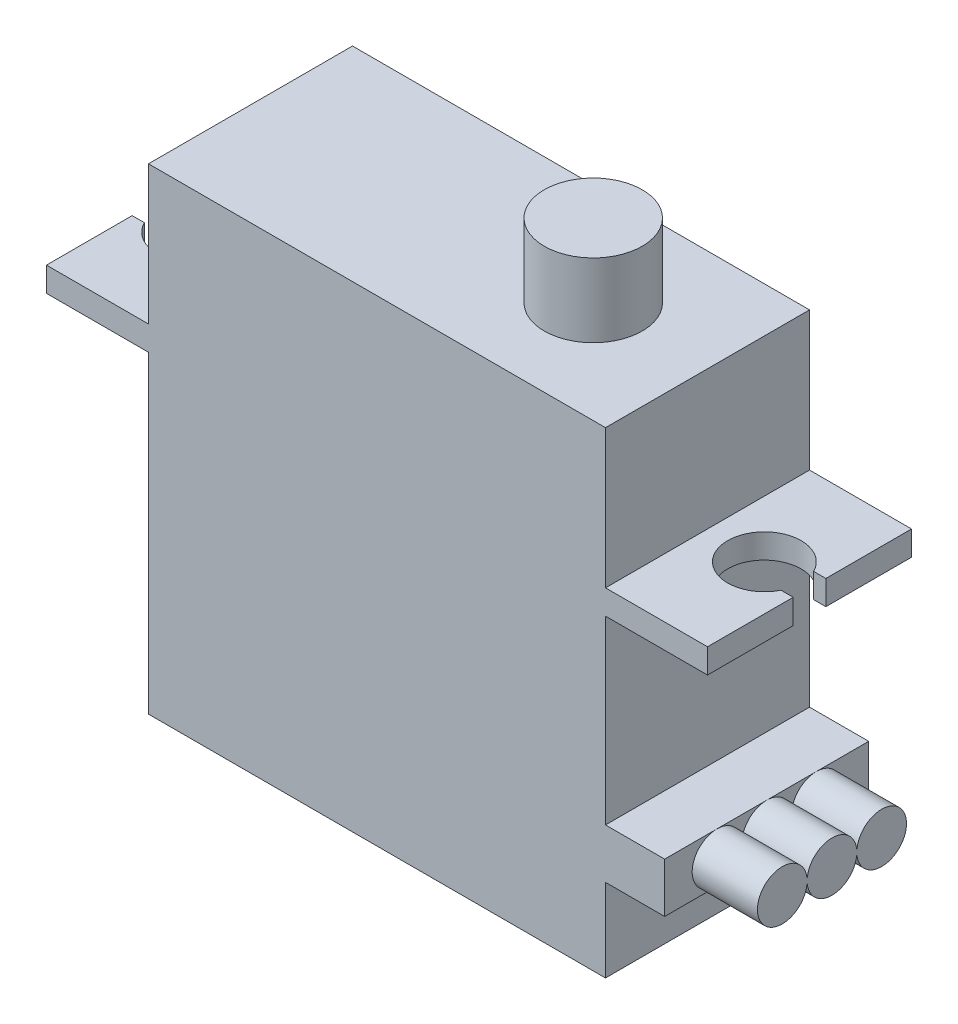
ISO-10303-21;
HEADER;
FILE_DESCRIPTION(('STEP AP214'),'2;1');
FILE_NAME('part.step','',(''),(''),'','','');
FILE_SCHEMA(('AUTOMOTIVE_DESIGN { 1 0 10303 214 1 1 1 1 }'));
ENDSEC;
DATA;
#1=APPLICATION_CONTEXT('core data for automotive mechanical design processes');
#2=APPLICATION_PROTOCOL_DEFINITION('international standard','automotive_design',2000,#1);
#3=PRODUCT_CONTEXT('',#1,'mechanical');
#4=PRODUCT('Part','Part','',(#3));
#5=PRODUCT_RELATED_PRODUCT_CATEGORY('part','',(#4));
#6=PRODUCT_DEFINITION_FORMATION('','',#4);
#7=PRODUCT_DEFINITION_CONTEXT('part definition',#1,'design');
#8=PRODUCT_DEFINITION('design','',#6,#7);
#9=PRODUCT_DEFINITION_SHAPE('','',#8);
#10=(LENGTH_UNIT() NAMED_UNIT(*) SI_UNIT(.MILLI.,.METRE.));
#11=(NAMED_UNIT(*) PLANE_ANGLE_UNIT() SI_UNIT($,.RADIAN.));
#12=(NAMED_UNIT(*) SI_UNIT($,.STERADIAN.) SOLID_ANGLE_UNIT());
#13=UNCERTAINTY_MEASURE_WITH_UNIT(LENGTH_MEASURE(1.E-05),#10,'distance_accuracy_value','');
#14=(GEOMETRIC_REPRESENTATION_CONTEXT(3) GLOBAL_UNCERTAINTY_ASSIGNED_CONTEXT((#13)) GLOBAL_UNIT_ASSIGNED_CONTEXT((#10,
#11,#12)) REPRESENTATION_CONTEXT('',''));
#15=CARTESIAN_POINT('',(0.,0.,0.));
#16=DIRECTION('',(0.,0.,1.));
#17=DIRECTION('',(1.,0.,0.));
#18=AXIS2_PLACEMENT_3D('',#15,#16,#17);
#19=CARTESIAN_POINT('',(17.6250167767219,-11.0792593212644,-10.983915300186));
#20=DIRECTION('',(1.,0.,0.));
#21=DIRECTION('',(0.,0.,-1.));
#22=AXIS2_PLACEMENT_3D('',#19,#20,#21);
#23=PLANE('',#22);
#24=CARTESIAN_POINT('',(17.6250167767219,-12.6015279767438,3.04453731095872));
#25=DIRECTION('',(-1.,0.,0.));
#26=DIRECTION('',(0.,0.,1.));
#27=AXIS2_PLACEMENT_3D('',#24,#25,#26);
#28=CIRCLE('',#27,1.52226865547936);
#29=CARTESIAN_POINT('',(17.6250167767219,-11.0792593212644,3.04453731095872));
#30=VERTEX_POINT('',#29);
#31=CARTESIAN_POINT('',(17.6250167767219,-12.4252302536132,1.53251185737868));
#32=VERTEX_POINT('',#31);
#33=EDGE_CURVE('E61',#30,#32,#28,.T.);
#34=ORIENTED_EDGE('',*,*,#33,.T.);
#35=DIRECTION('',(0.,0.,-1.));
#36=VECTOR('',#35,1.);
#37=CARTESIAN_POINT('',(17.6250167767219,-12.4252302536132,1.53251185737868));
#38=LINE('',#37,#36);
#39=CARTESIAN_POINT('',(17.6250167767219,-12.4252302536132,1.51202545358004));
#40=VERTEX_POINT('',#39);
#41=EDGE_CURVE('E326',#32,#40,#38,.T.);
#42=ORIENTED_EDGE('',*,*,#41,.T.);
#43=CARTESIAN_POINT('',(17.6250167767219,-12.6015279767438,0.));
#44=DIRECTION('',(1.,0.,0.));
#45=DIRECTION('',(0.,0.,-1.));
#46=AXIS2_PLACEMENT_3D('',#43,#44,#45);
#47=CIRCLE('',#46,1.52226865547936);
#48=CARTESIAN_POINT('',(17.6250167767219,-11.0792593212644,0.));
#49=VERTEX_POINT('',#48);
#50=EDGE_CURVE('E294',#49,#40,#47,.T.);
#51=ORIENTED_EDGE('',*,*,#50,.F.);
#52=DIRECTION('',(0.,0.,1.));
#53=VECTOR('',#52,1.);
#54=CARTESIAN_POINT('',(17.6250167767219,-11.0792593212644,-10.983915300186));
#55=LINE('',#54,#53);
#56=EDGE_CURVE('E676',#49,#30,#55,.T.);
#57=ORIENTED_EDGE('',*,*,#56,.T.);
#58=EDGE_LOOP('',(#34,#42,#51,#57));
#59=FACE_BOUND('',#58,.T.);
#60=ADVANCED_FACE('F45',(#59),#23,.T.);
#61=CARTESIAN_POINT('',(17.6250167767219,-14.1237966322231,3.04453731095872));
#62=VERTEX_POINT('',#61);
#63=EDGE_CURVE('E332',#62,#30,#28,.T.);
#64=ORIENTED_EDGE('',*,*,#63,.T.);
#65=CARTESIAN_POINT('',(17.6250167767219,-11.0792593212644,6.25));
#66=VERTEX_POINT('',#65);
#67=EDGE_CURVE('E403',#30,#66,#55,.T.);
#68=ORIENTED_EDGE('',*,*,#67,.T.);
#69=DIRECTION('',(0.,1.,0.));
#70=VECTOR('',#69,1.);
#71=CARTESIAN_POINT('',(17.6250167767219,-11.0792593212644,6.25));
#72=LINE('',#71,#70);
#73=CARTESIAN_POINT('',(17.6250167767219,-14.1237966322231,6.25));
#74=VERTEX_POINT('',#73);
#75=EDGE_CURVE('E386',#74,#66,#72,.T.);
#76=ORIENTED_EDGE('',*,*,#75,.F.);
#77=DIRECTION('',(0.,0.,1.));
#78=VECTOR('',#77,1.);
#79=CARTESIAN_POINT('',(17.6250167767219,-14.1237966322231,-10.983915300186));
#80=LINE('',#79,#78);
#81=EDGE_CURVE('E409',#62,#74,#80,.T.);
#82=ORIENTED_EDGE('',*,*,#81,.F.);
#83=EDGE_LOOP('',(#64,#68,#76,#82));
#84=FACE_BOUND('',#83,.T.);
#85=ADVANCED_FACE('F694',(#84),#23,.T.);
#86=DIRECTION('',(0.,0.,-1.));
#87=VECTOR('',#86,1.);
#88=CARTESIAN_POINT('',(17.6250167767219,-12.7778256998743,-1.51202545358004));
#89=LINE('',#88,#87);
#90=CARTESIAN_POINT('',(17.6250167767219,-12.7778256998743,-1.51202545358004));
#91=VERTEX_POINT('',#90);
#92=CARTESIAN_POINT('',(17.6250167767219,-12.7778256998743,-1.53251185737868));
#93=VERTEX_POINT('',#92);
#94=EDGE_CURVE('E340',#91,#93,#89,.T.);
#95=ORIENTED_EDGE('',*,*,#94,.F.);
#96=CARTESIAN_POINT('',(17.6250167767219,-12.6015279767438,0.));
#97=DIRECTION('',(1.,0.,0.));
#98=DIRECTION('',(0.,0.,-1.));
#99=AXIS2_PLACEMENT_3D('',#96,#97,#98);
#100=CIRCLE('',#99,1.52226865547936);
#101=CARTESIAN_POINT('',(17.6250167767219,-14.1237966322231,0.));
#102=VERTEX_POINT('',#101);
#103=EDGE_CURVE('E335',#102,#91,#100,.T.);
#104=ORIENTED_EDGE('',*,*,#103,.F.);
#105=CARTESIAN_POINT('',(17.6250167767219,-14.1237966322231,-3.04453731095872));
#106=VERTEX_POINT('',#105);
#107=EDGE_CURVE('E408',#106,#102,#80,.T.);
#108=ORIENTED_EDGE('',*,*,#107,.F.);
#109=CARTESIAN_POINT('',(17.6250167767219,-12.6015279767438,-3.04453731095872));
#110=DIRECTION('',(1.,0.,0.));
#111=DIRECTION('',(0.,0.,-1.));
#112=AXIS2_PLACEMENT_3D('',#109,#110,#111);
#113=CIRCLE('',#112,1.52226865547936);
#114=EDGE_CURVE('E345',#93,#106,#113,.T.);
#115=ORIENTED_EDGE('',*,*,#114,.F.);
#116=EDGE_LOOP('',(#95,#104,#108,#115));
#117=FACE_BOUND('',#116,.T.);
#118=ADVANCED_FACE('F713',(#117),#23,.T.);
#119=CARTESIAN_POINT('',(17.6250167767219,-11.0792593212644,-6.25));
#120=VERTEX_POINT('',#119);
#121=CARTESIAN_POINT('',(17.6250167767219,-11.0792593212644,-3.04453731095872));
#122=VERTEX_POINT('',#121);
#123=EDGE_CURVE('E398',#120,#122,#55,.T.);
#124=ORIENTED_EDGE('',*,*,#123,.T.);
#125=EDGE_CURVE('E349',#106,#122,#113,.T.);
#126=ORIENTED_EDGE('',*,*,#125,.F.);
#127=CARTESIAN_POINT('',(17.6250167767219,-14.1237966322231,-6.25));
#128=VERTEX_POINT('',#127);
#129=EDGE_CURVE('E404',#128,#106,#80,.T.);
#130=ORIENTED_EDGE('',*,*,#129,.F.);
#131=DIRECTION('',(0.,-1.,0.));
#132=VECTOR('',#131,1.);
#133=CARTESIAN_POINT('',(17.6250167767219,-11.0792593212644,-6.25));
#134=LINE('',#133,#132);
#135=EDGE_CURVE('E375',#120,#128,#134,.T.);
#136=ORIENTED_EDGE('',*,*,#135,.F.);
#137=EDGE_LOOP('',(#124,#126,#130,#136));
#138=FACE_BOUND('',#137,.T.);
#139=ADVANCED_FACE('F706',(#138),#23,.T.);
#140=EDGE_CURVE('E402',#122,#49,#55,.T.);
#141=ORIENTED_EDGE('',*,*,#140,.T.);
#142=CARTESIAN_POINT('',(17.6250167767219,-12.4252302536132,-1.51202545358004));
#143=VERTEX_POINT('',#142);
#144=EDGE_CURVE('E323',#143,#49,#47,.T.);
#145=ORIENTED_EDGE('',*,*,#144,.F.);
#146=DIRECTION('',(0.,0.,-1.));
#147=VECTOR('',#146,1.);
#148=CARTESIAN_POINT('',(17.6250167767219,-12.4252302536132,-1.51202545358004));
#149=LINE('',#148,#147);
#150=CARTESIAN_POINT('',(17.6250167767219,-12.4252302536132,-1.53251185737868));
#151=VERTEX_POINT('',#150);
#152=EDGE_CURVE('E287',#143,#151,#149,.T.);
#153=ORIENTED_EDGE('',*,*,#152,.T.);
#154=EDGE_CURVE('E344',#122,#151,#113,.T.);
#155=ORIENTED_EDGE('',*,*,#154,.F.);
#156=EDGE_LOOP('',(#141,#145,#153,#155));
#157=FACE_BOUND('',#156,.T.);
#158=ADVANCED_FACE('F740',(#157),#23,.T.);
#159=CARTESIAN_POINT('',(14.,-19.2,-6.25));
#160=DIRECTION('',(-1.,0.,0.));
#161=DIRECTION('',(0.,0.,1.));
#162=AXIS2_PLACEMENT_3D('',#159,#160,#161);
#163=PLANE('',#162);
#164=DIRECTION('',(0.,1.,0.));
#165=VECTOR('',#164,1.);
#166=CARTESIAN_POINT('',(14.,-19.2,6.25));
#167=LINE('',#166,#165);
#168=CARTESIAN_POINT('',(14.,-11.0792593212644,6.25));
#169=VERTEX_POINT('',#168);
#170=CARTESIAN_POINT('',(14.,0.,6.25));
#171=VERTEX_POINT('',#170);
#172=EDGE_CURVE('E440',#169,#171,#167,.T.);
#173=ORIENTED_EDGE('',*,*,#172,.F.);
#174=DIRECTION('',(0.,0.,1.));
#175=VECTOR('',#174,1.);
#176=CARTESIAN_POINT('',(14.,-11.0792593212644,-10.983915300186));
#177=LINE('',#176,#175);
#178=CARTESIAN_POINT('',(14.,-11.0792593212644,-6.25));
#179=VERTEX_POINT('',#178);
#180=EDGE_CURVE('E379',#179,#169,#177,.T.);
#181=ORIENTED_EDGE('',*,*,#180,.F.);
#182=DIRECTION('',(0.,1.,0.));
#183=VECTOR('',#182,1.);
#184=CARTESIAN_POINT('',(14.,-19.2,-6.25));
#185=LINE('',#184,#183);
#186=CARTESIAN_POINT('',(14.,0.,-6.25));
#187=VERTEX_POINT('',#186);
#188=EDGE_CURVE('E445',#179,#187,#185,.T.);
#189=ORIENTED_EDGE('',*,*,#188,.T.);
#190=DIRECTION('',(0.,0.,1.));
#191=VECTOR('',#190,1.);
#192=CARTESIAN_POINT('',(14.,0.,-6.25));
#193=LINE('',#192,#191);
#194=EDGE_CURVE('E421',#187,#171,#193,.T.);
#195=ORIENTED_EDGE('',*,*,#194,.T.);
#196=EDGE_LOOP('',(#173,#181,#189,#195));
#197=FACE_BOUND('',#196,.T.);
#198=ADVANCED_FACE('F759',(#197),#163,.F.);
#199=CARTESIAN_POINT('',(17.4844355629254,0.,0.));
#200=DIRECTION('',(0.,1.,0.));
#201=DIRECTION('',(0.,0.,1.));
#202=AXIS2_PLACEMENT_3D('',#199,#200,#201);
#203=PLANE('',#202);
#204=DIRECTION('',(0.,0.,-1.));
#205=VECTOR('',#204,1.);
#206=CARTESIAN_POINT('',(-14.,0.,-6.25));
#207=LINE('',#206,#205);
#208=CARTESIAN_POINT('',(-14.,0.,6.25));
#209=VERTEX_POINT('',#208);
#210=CARTESIAN_POINT('',(-14.,0.,-6.25));
#211=VERTEX_POINT('',#210);
#212=EDGE_CURVE('E415',#209,#211,#207,.T.);
#213=ORIENTED_EDGE('',*,*,#212,.F.);
#214=DIRECTION('',(1.,0.,0.));
#215=VECTOR('',#214,1.);
#216=CARTESIAN_POINT('',(20.25,0.,6.25));
#217=LINE('',#216,#215);
#218=CARTESIAN_POINT('',(-20.25,0.,6.25));
#219=VERTEX_POINT('',#218);
#220=EDGE_CURVE('E556',#219,#209,#217,.T.);
#221=ORIENTED_EDGE('',*,*,#220,.F.);
#222=DIRECTION('',(0.,0.,1.));
#223=VECTOR('',#222,1.);
#224=CARTESIAN_POINT('',(-20.25,0.,6.25));
#225=LINE('',#224,#223);
#226=CARTESIAN_POINT('',(-20.25,0.,1.));
#227=VERTEX_POINT('',#226);
#228=EDGE_CURVE('E552',#227,#219,#225,.T.);
#229=ORIENTED_EDGE('',*,*,#228,.F.);
#230=DIRECTION('',(-1.,0.,0.));
#231=VECTOR('',#230,1.);
#232=CARTESIAN_POINT('',(-19.5,0.,1.));
#233=LINE('',#232,#231);
#234=CARTESIAN_POINT('',(-19.5,0.,1.));
#235=VERTEX_POINT('',#234);
#236=EDGE_CURVE('E549',#235,#227,#233,.T.);
#237=ORIENTED_EDGE('',*,*,#236,.F.);
#238=CARTESIAN_POINT('',(-17.4844355629254,0.,0.));
#239=DIRECTION('',(0.,-1.,0.));
#240=DIRECTION('',(0.,0.,-1.));
#241=AXIS2_PLACEMENT_3D('',#238,#239,#240);
#242=CIRCLE('',#241,2.25);
#243=CARTESIAN_POINT('',(-19.5,0.,-0.999999999999998));
#244=VERTEX_POINT('',#243);
#245=EDGE_CURVE('E546',#244,#235,#242,.T.);
#246=ORIENTED_EDGE('',*,*,#245,.F.);
#247=DIRECTION('',(1.,0.,0.));
#248=VECTOR('',#247,1.);
#249=CARTESIAN_POINT('',(-19.5,0.,-0.999999999999999));
#250=LINE('',#249,#248);
#251=CARTESIAN_POINT('',(-20.25,0.,-0.999999999999999));
#252=VERTEX_POINT('',#251);
#253=EDGE_CURVE('E543',#252,#244,#250,.T.);
#254=ORIENTED_EDGE('',*,*,#253,.F.);
#255=DIRECTION('',(0.,0.,1.));
#256=VECTOR('',#255,1.);
#257=CARTESIAN_POINT('',(-20.25,0.,-0.999999999999999));
#258=LINE('',#257,#256);
#259=CARTESIAN_POINT('',(-20.25,0.,-6.25));
#260=VERTEX_POINT('',#259);
#261=EDGE_CURVE('E498',#260,#252,#258,.T.);
#262=ORIENTED_EDGE('',*,*,#261,.F.);
#263=DIRECTION('',(-1.,0.,0.));
#264=VECTOR('',#263,1.);
#265=CARTESIAN_POINT('',(20.25,0.,-6.25));
#266=LINE('',#265,#264);
#267=EDGE_CURVE('E575',#211,#260,#266,.T.);
#268=ORIENTED_EDGE('',*,*,#267,.F.);
#269=EDGE_LOOP('',(#213,#221,#229,#237,#246,#254,#262,#268));
#270=FACE_BOUND('',#269,.T.);
#271=ADVANCED_FACE('F628',(#270),#203,.F.);
#272=ORIENTED_EDGE('',*,*,#194,.F.);
#273=CARTESIAN_POINT('',(20.25,0.,-6.25));
#274=VERTEX_POINT('',#273);
#275=EDGE_CURVE('E504',#274,#187,#266,.T.);
#276=ORIENTED_EDGE('',*,*,#275,.F.);
#277=DIRECTION('',(0.,0.,-1.));
#278=VECTOR('',#277,1.);
#279=CARTESIAN_POINT('',(20.25,0.,-0.999999999999999));
#280=LINE('',#279,#278);
#281=CARTESIAN_POINT('',(20.25,0.,-0.999999999999999));
#282=VERTEX_POINT('',#281);
#283=EDGE_CURVE('E572',#282,#274,#280,.T.);
#284=ORIENTED_EDGE('',*,*,#283,.F.);
#285=DIRECTION('',(1.,0.,0.));
#286=VECTOR('',#285,1.);
#287=CARTESIAN_POINT('',(19.5,0.,-0.999999999999999));
#288=LINE('',#287,#286);
#289=CARTESIAN_POINT('',(19.5,0.,-0.999999999999999));
#290=VERTEX_POINT('',#289);
#291=EDGE_CURVE('E569',#290,#282,#288,.T.);
#292=ORIENTED_EDGE('',*,*,#291,.F.);
#293=CARTESIAN_POINT('',(17.4844355629254,0.,0.));
#294=DIRECTION('',(0.,-1.,0.));
#295=DIRECTION('',(0.,0.,1.));
#296=AXIS2_PLACEMENT_3D('',#293,#294,#295);
#297=CIRCLE('',#296,2.25);
#298=CARTESIAN_POINT('',(19.5,0.,1.));
#299=VERTEX_POINT('',#298);
#300=EDGE_CURVE('E566',#299,#290,#297,.T.);
#301=ORIENTED_EDGE('',*,*,#300,.F.);
#302=DIRECTION('',(-1.,0.,0.));
#303=VECTOR('',#302,1.);
#304=CARTESIAN_POINT('',(19.5,0.,1.));
#305=LINE('',#304,#303);
#306=CARTESIAN_POINT('',(20.25,0.,1.));
#307=VERTEX_POINT('',#306);
#308=EDGE_CURVE('E563',#307,#299,#305,.T.);
#309=ORIENTED_EDGE('',*,*,#308,.F.);
#310=DIRECTION('',(0.,0.,-1.));
#311=VECTOR('',#310,1.);
#312=CARTESIAN_POINT('',(20.25,0.,6.25));
#313=LINE('',#312,#311);
#314=CARTESIAN_POINT('',(20.25,0.,6.25));
#315=VERTEX_POINT('',#314);
#316=EDGE_CURVE('E560',#315,#307,#313,.T.);
#317=ORIENTED_EDGE('',*,*,#316,.F.);
#318=EDGE_CURVE('E555',#171,#315,#217,.T.);
#319=ORIENTED_EDGE('',*,*,#318,.F.);
#320=EDGE_LOOP('',(#272,#276,#284,#292,#301,#309,#317,#319));
#321=FACE_BOUND('',#320,.T.);
#322=ADVANCED_FACE('F938',(#321),#203,.F.);
#323=CARTESIAN_POINT('',(17.4844355629254,1.5,0.));
#324=DIRECTION('',(0.,1.,0.));
#325=DIRECTION('',(0.,0.,1.));
#326=AXIS2_PLACEMENT_3D('',#323,#324,#325);
#327=PLANE('',#326);
#328=DIRECTION('',(0.,0.,1.));
#329=VECTOR('',#328,1.);
#330=CARTESIAN_POINT('',(-14.,1.5,6.25));
#331=LINE('',#330,#329);
#332=CARTESIAN_POINT('',(-14.,1.5,-6.25));
#333=VERTEX_POINT('',#332);
#334=CARTESIAN_POINT('',(-14.,1.5,6.25));
#335=VERTEX_POINT('',#334);
#336=EDGE_CURVE('E458',#333,#335,#331,.T.);
#337=ORIENTED_EDGE('',*,*,#336,.F.);
#338=DIRECTION('',(-1.,0.,0.));
#339=VECTOR('',#338,1.);
#340=CARTESIAN_POINT('',(20.25,1.5,-6.25));
#341=LINE('',#340,#339);
#342=CARTESIAN_POINT('',(-20.25,1.5,-6.25));
#343=VERTEX_POINT('',#342);
#344=EDGE_CURVE('E535',#333,#343,#341,.T.);
#345=ORIENTED_EDGE('',*,*,#344,.T.);
#346=DIRECTION('',(0.,0.,1.));
#347=VECTOR('',#346,1.);
#348=CARTESIAN_POINT('',(-20.25,1.5,-0.999999999999999));
#349=LINE('',#348,#347);
#350=CARTESIAN_POINT('',(-20.25,1.5,-0.999999999999999));
#351=VERTEX_POINT('',#350);
#352=EDGE_CURVE('E499',#343,#351,#349,.T.);
#353=ORIENTED_EDGE('',*,*,#352,.T.);
#354=DIRECTION('',(1.,0.,0.));
#355=VECTOR('',#354,1.);
#356=CARTESIAN_POINT('',(-19.5,1.5,-0.999999999999999));
#357=LINE('',#356,#355);
#358=CARTESIAN_POINT('',(-19.5,1.5,-0.999999999999998));
#359=VERTEX_POINT('',#358);
#360=EDGE_CURVE('E503',#351,#359,#357,.T.);
#361=ORIENTED_EDGE('',*,*,#360,.T.);
#362=CARTESIAN_POINT('',(-17.4844355629254,1.5,0.));
#363=DIRECTION('',(0.,-1.,0.));
#364=DIRECTION('',(0.,0.,-1.));
#365=AXIS2_PLACEMENT_3D('',#362,#363,#364);
#366=CIRCLE('',#365,2.25);
#367=CARTESIAN_POINT('',(-19.5,1.5,1.));
#368=VERTEX_POINT('',#367);
#369=EDGE_CURVE('E507',#359,#368,#366,.T.);
#370=ORIENTED_EDGE('',*,*,#369,.T.);
#371=DIRECTION('',(-1.,0.,0.));
#372=VECTOR('',#371,1.);
#373=CARTESIAN_POINT('',(-19.5,1.5,1.));
#374=LINE('',#373,#372);
#375=CARTESIAN_POINT('',(-20.25,1.5,1.));
#376=VERTEX_POINT('',#375);
#377=EDGE_CURVE('E510',#368,#376,#374,.T.);
#378=ORIENTED_EDGE('',*,*,#377,.T.);
#379=DIRECTION('',(0.,0.,1.));
#380=VECTOR('',#379,1.);
#381=CARTESIAN_POINT('',(-20.25,1.5,6.25));
#382=LINE('',#381,#380);
#383=CARTESIAN_POINT('',(-20.25,1.5,6.25));
#384=VERTEX_POINT('',#383);
#385=EDGE_CURVE('E513',#376,#384,#382,.T.);
#386=ORIENTED_EDGE('',*,*,#385,.T.);
#387=DIRECTION('',(1.,0.,0.));
#388=VECTOR('',#387,1.);
#389=CARTESIAN_POINT('',(20.25,1.5,6.25));
#390=LINE('',#389,#388);
#391=EDGE_CURVE('E517',#384,#335,#390,.T.);
#392=ORIENTED_EDGE('',*,*,#391,.T.);
#393=EDGE_LOOP('',(#337,#345,#353,#361,#370,#378,#386,#392));
#394=FACE_BOUND('',#393,.T.);
#395=ADVANCED_FACE('F642',(#394),#327,.T.);
#396=CARTESIAN_POINT('',(-20.25,1.5,-0.999999999999999));
#397=DIRECTION('',(1.,0.,0.));
#398=DIRECTION('',(0.,0.,-1.));
#399=AXIS2_PLACEMENT_3D('',#396,#397,#398);
#400=PLANE('',#399);
#401=ORIENTED_EDGE('',*,*,#261,.T.);
#402=DIRECTION('',(0.,-1.,0.));
#403=VECTOR('',#402,1.);
#404=CARTESIAN_POINT('',(-20.25,1.5,-0.999999999999999));
#405=LINE('',#404,#403);
#406=EDGE_CURVE('E11',#351,#252,#405,.T.);
#407=ORIENTED_EDGE('',*,*,#406,.F.);
#408=ORIENTED_EDGE('',*,*,#352,.F.);
#409=DIRECTION('',(0.,-1.,0.));
#410=VECTOR('',#409,1.);
#411=CARTESIAN_POINT('',(-20.25,1.5,-6.25));
#412=LINE('',#411,#410);
#413=EDGE_CURVE('E539',#343,#260,#412,.T.);
#414=ORIENTED_EDGE('',*,*,#413,.T.);
#415=EDGE_LOOP('',(#401,#407,#408,#414));
#416=FACE_BOUND('',#415,.T.);
#417=ADVANCED_FACE('F47',(#416),#400,.F.);
#418=CARTESIAN_POINT('',(-19.5,1.5,-0.999999999999999));
#419=DIRECTION('',(0.,0.,-1.));
#420=DIRECTION('',(-1.,0.,0.));
#421=AXIS2_PLACEMENT_3D('',#418,#419,#420);
#422=PLANE('',#421);
#423=ORIENTED_EDGE('',*,*,#253,.T.);
#424=DIRECTION('',(0.,-1.,0.));
#425=VECTOR('',#424,1.);
#426=CARTESIAN_POINT('',(-19.5,1.5,-0.999999999999998));
#427=LINE('',#426,#425);
#428=EDGE_CURVE('E54',#359,#244,#427,.T.);
#429=ORIENTED_EDGE('',*,*,#428,.F.);
#430=ORIENTED_EDGE('',*,*,#360,.F.);
#431=ORIENTED_EDGE('',*,*,#406,.T.);
#432=EDGE_LOOP('',(#423,#429,#430,#431));
#433=FACE_BOUND('',#432,.T.);
#434=ADVANCED_FACE('F645',(#433),#422,.F.);
#435=CARTESIAN_POINT('',(-17.4844355629254,1.5,0.));
#436=DIRECTION('',(0.,-1.,0.));
#437=DIRECTION('',(0.,0.,-1.));
#438=AXIS2_PLACEMENT_3D('',#435,#436,#437);
#439=CYLINDRICAL_SURFACE('',#438,2.25);
#440=ORIENTED_EDGE('',*,*,#245,.T.);
#441=DIRECTION('',(0.,-1.,0.));
#442=VECTOR('',#441,1.);
#443=CARTESIAN_POINT('',(-19.5,1.5,1.));
#444=LINE('',#443,#442);
#445=EDGE_CURVE('E614',#368,#235,#444,.T.);
#446=ORIENTED_EDGE('',*,*,#445,.F.);
#447=ORIENTED_EDGE('',*,*,#369,.F.);
#448=ORIENTED_EDGE('',*,*,#428,.T.);
#449=EDGE_LOOP('',(#440,#446,#447,#448));
#450=FACE_BOUND('',#449,.T.);
#451=ADVANCED_FACE('F623',(#450),#439,.F.);
#452=CARTESIAN_POINT('',(-19.5,1.5,1.));
#453=DIRECTION('',(0.,0.,1.));
#454=DIRECTION('',(1.,0.,0.));
#455=AXIS2_PLACEMENT_3D('',#452,#453,#454);
#456=PLANE('',#455);
#457=ORIENTED_EDGE('',*,*,#236,.T.);
#458=DIRECTION('',(0.,-1.,0.));
#459=VECTOR('',#458,1.);
#460=CARTESIAN_POINT('',(-20.25,1.5,1.));
#461=LINE('',#460,#459);
#462=EDGE_CURVE('E610',#376,#227,#461,.T.);
#463=ORIENTED_EDGE('',*,*,#462,.F.);
#464=ORIENTED_EDGE('',*,*,#377,.F.);
#465=ORIENTED_EDGE('',*,*,#445,.T.);
#466=EDGE_LOOP('',(#457,#463,#464,#465));
#467=FACE_BOUND('',#466,.T.);
#468=ADVANCED_FACE('F634',(#467),#456,.F.);
#469=CARTESIAN_POINT('',(-20.25,1.5,6.25));
#470=DIRECTION('',(1.,0.,0.));
#471=DIRECTION('',(0.,0.,-1.));
#472=AXIS2_PLACEMENT_3D('',#469,#470,#471);
#473=PLANE('',#472);
#474=ORIENTED_EDGE('',*,*,#228,.T.);
#475=DIRECTION('',(0.,-1.,0.));
#476=VECTOR('',#475,1.);
#477=CARTESIAN_POINT('',(-20.25,1.5,6.25));
#478=LINE('',#477,#476);
#479=EDGE_CURVE('E606',#384,#219,#478,.T.);
#480=ORIENTED_EDGE('',*,*,#479,.F.);
#481=ORIENTED_EDGE('',*,*,#385,.F.);
#482=ORIENTED_EDGE('',*,*,#462,.T.);
#483=EDGE_LOOP('',(#474,#480,#481,#482));
#484=FACE_BOUND('',#483,.T.);
#485=ADVANCED_FACE('F638',(#484),#473,.F.);
#486=CARTESIAN_POINT('',(20.25,1.5,6.25));
#487=DIRECTION('',(0.,0.,-1.));
#488=DIRECTION('',(-1.,0.,0.));
#489=AXIS2_PLACEMENT_3D('',#486,#487,#488);
#490=PLANE('',#489);
#491=ORIENTED_EDGE('',*,*,#220,.T.);
#492=DIRECTION('',(0.,1.,0.));
#493=VECTOR('',#492,1.);
#494=CARTESIAN_POINT('',(-14.,-19.2,6.25));
#495=LINE('',#494,#493);
#496=CARTESIAN_POINT('',(-14.,-19.2,6.25));
#497=VERTEX_POINT('',#496);
#498=EDGE_CURVE('E430',#497,#209,#495,.T.);
#499=ORIENTED_EDGE('',*,*,#498,.F.);
#500=DIRECTION('',(-1.,0.,0.));
#501=VECTOR('',#500,1.);
#502=CARTESIAN_POINT('',(14.,-19.2,6.25));
#503=LINE('',#502,#501);
#504=CARTESIAN_POINT('',(14.,-19.2,6.25));
#505=VERTEX_POINT('',#504);
#506=EDGE_CURVE('E427',#505,#497,#503,.T.);
#507=ORIENTED_EDGE('',*,*,#506,.F.);
#508=CARTESIAN_POINT('',(14.,-14.1237966322231,6.25));
#509=VERTEX_POINT('',#508);
#510=EDGE_CURVE('E441',#505,#509,#167,.T.);
#511=ORIENTED_EDGE('',*,*,#510,.T.);
#512=DIRECTION('',(1.,0.,0.));
#513=VECTOR('',#512,1.);
#514=CARTESIAN_POINT('',(14.,-14.1237966322231,6.25));
#515=LINE('',#514,#513);
#516=EDGE_CURVE('E298',#509,#74,#515,.T.);
#517=ORIENTED_EDGE('',*,*,#516,.T.);
#518=ORIENTED_EDGE('',*,*,#75,.T.);
#519=DIRECTION('',(-1.,0.,0.));
#520=VECTOR('',#519,1.);
#521=CARTESIAN_POINT('',(14.,-11.0792593212644,6.25));
#522=LINE('',#521,#520);
#523=EDGE_CURVE('E390',#66,#169,#522,.T.);
#524=ORIENTED_EDGE('',*,*,#523,.T.);
#525=ORIENTED_EDGE('',*,*,#172,.T.);
#526=ORIENTED_EDGE('',*,*,#318,.T.);
#527=DIRECTION('',(0.,-1.,0.));
#528=VECTOR('',#527,1.);
#529=CARTESIAN_POINT('',(20.25,1.5,6.25));
#530=LINE('',#529,#528);
#531=CARTESIAN_POINT('',(20.25,1.5,6.25));
#532=VERTEX_POINT('',#531);
#533=EDGE_CURVE('E602',#532,#315,#530,.T.);
#534=ORIENTED_EDGE('',*,*,#533,.F.);
#535=CARTESIAN_POINT('',(14.,1.5,6.25));
#536=VERTEX_POINT('',#535);
#537=EDGE_CURVE('E516',#536,#532,#390,.T.);
#538=ORIENTED_EDGE('',*,*,#537,.F.);
#539=DIRECTION('',(0.,-1.,0.));
#540=VECTOR('',#539,1.);
#541=CARTESIAN_POINT('',(14.,10.,6.25));
#542=LINE('',#541,#540);
#543=CARTESIAN_POINT('',(14.,10.,6.25));
#544=VERTEX_POINT('',#543);
#545=EDGE_CURVE('E490',#544,#536,#542,.T.);
#546=ORIENTED_EDGE('',*,*,#545,.F.);
#547=DIRECTION('',(1.,0.,0.));
#548=VECTOR('',#547,1.);
#549=CARTESIAN_POINT('',(14.,10.,6.25));
#550=LINE('',#549,#548);
#551=CARTESIAN_POINT('',(-14.,10.,6.25));
#552=VERTEX_POINT('',#551);
#553=EDGE_CURVE('E466',#552,#544,#550,.T.);
#554=ORIENTED_EDGE('',*,*,#553,.F.);
#555=DIRECTION('',(0.,-1.,0.));
#556=VECTOR('',#555,1.);
#557=CARTESIAN_POINT('',(-14.,10.,6.25));
#558=LINE('',#557,#556);
#559=EDGE_CURVE('E494',#552,#335,#558,.T.);
#560=ORIENTED_EDGE('',*,*,#559,.T.);
#561=ORIENTED_EDGE('',*,*,#391,.F.);
#562=ORIENTED_EDGE('',*,*,#479,.T.);
#563=EDGE_LOOP('',(#491,#499,#507,#511,#517,#518,#524,#525,#526,#534,#538,#546,#554,#560,#561,#562));
#564=FACE_BOUND('',#563,.T.);
#565=ADVANCED_FACE('F659',(#564),#490,.F.);
#566=CARTESIAN_POINT('',(20.25,1.5,6.25));
#567=DIRECTION('',(-1.,0.,0.));
#568=DIRECTION('',(0.,0.,1.));
#569=AXIS2_PLACEMENT_3D('',#566,#567,#568);
#570=PLANE('',#569);
#571=ORIENTED_EDGE('',*,*,#316,.T.);
#572=DIRECTION('',(0.,-1.,0.));
#573=VECTOR('',#572,1.);
#574=CARTESIAN_POINT('',(20.25,1.5,1.));
#575=LINE('',#574,#573);
#576=CARTESIAN_POINT('',(20.25,1.5,1.));
#577=VERTEX_POINT('',#576);
#578=EDGE_CURVE('E598',#577,#307,#575,.T.);
#579=ORIENTED_EDGE('',*,*,#578,.F.);
#580=DIRECTION('',(0.,0.,-1.));
#581=VECTOR('',#580,1.);
#582=CARTESIAN_POINT('',(20.25,1.5,6.25));
#583=LINE('',#582,#581);
#584=EDGE_CURVE('E520',#532,#577,#583,.T.);
#585=ORIENTED_EDGE('',*,*,#584,.F.);
#586=ORIENTED_EDGE('',*,*,#533,.T.);
#587=EDGE_LOOP('',(#571,#579,#585,#586));
#588=FACE_BOUND('',#587,.T.);
#589=ADVANCED_FACE('F903',(#588),#570,.F.);
#590=CARTESIAN_POINT('',(19.5,1.5,1.));
#591=DIRECTION('',(0.,0.,1.));
#592=DIRECTION('',(1.,0.,0.));
#593=AXIS2_PLACEMENT_3D('',#590,#591,#592);
#594=PLANE('',#593);
#595=ORIENTED_EDGE('',*,*,#308,.T.);
#596=DIRECTION('',(0.,-1.,0.));
#597=VECTOR('',#596,1.);
#598=CARTESIAN_POINT('',(19.5,1.5,1.));
#599=LINE('',#598,#597);
#600=CARTESIAN_POINT('',(19.5,1.5,1.));
#601=VERTEX_POINT('',#600);
#602=EDGE_CURVE('E594',#601,#299,#599,.T.);
#603=ORIENTED_EDGE('',*,*,#602,.F.);
#604=DIRECTION('',(-1.,0.,0.));
#605=VECTOR('',#604,1.);
#606=CARTESIAN_POINT('',(19.5,1.5,1.));
#607=LINE('',#606,#605);
#608=EDGE_CURVE('E523',#577,#601,#607,.T.);
#609=ORIENTED_EDGE('',*,*,#608,.F.);
#610=ORIENTED_EDGE('',*,*,#578,.T.);
#611=EDGE_LOOP('',(#595,#603,#609,#610));
#612=FACE_BOUND('',#611,.T.);
#613=ADVANCED_FACE('F1026',(#612),#594,.F.);
#614=CARTESIAN_POINT('',(17.4844355629254,1.5,0.));
#615=DIRECTION('',(0.,-1.,0.));
#616=DIRECTION('',(0.,0.,-1.));
#617=AXIS2_PLACEMENT_3D('',#614,#615,#616);
#618=CYLINDRICAL_SURFACE('',#617,2.25);
#619=ORIENTED_EDGE('',*,*,#300,.T.);
#620=DIRECTION('',(0.,-1.,0.));
#621=VECTOR('',#620,1.);
#622=CARTESIAN_POINT('',(19.5,1.5,-0.999999999999999));
#623=LINE('',#622,#621);
#624=CARTESIAN_POINT('',(19.5,1.5,-0.999999999999999));
#625=VERTEX_POINT('',#624);
#626=EDGE_CURVE('E590',#625,#290,#623,.T.);
#627=ORIENTED_EDGE('',*,*,#626,.F.);
#628=CARTESIAN_POINT('',(17.4844355629254,1.5,0.));
#629=DIRECTION('',(0.,-1.,0.));
#630=DIRECTION('',(0.,0.,1.));
#631=AXIS2_PLACEMENT_3D('',#628,#629,#630);
#632=CIRCLE('',#631,2.25);
#633=EDGE_CURVE('E526',#601,#625,#632,.T.);
#634=ORIENTED_EDGE('',*,*,#633,.F.);
#635=ORIENTED_EDGE('',*,*,#602,.T.);
#636=EDGE_LOOP('',(#619,#627,#634,#635));
#637=FACE_BOUND('',#636,.T.);
#638=ADVANCED_FACE('F1017',(#637),#618,.F.);
#639=CARTESIAN_POINT('',(19.5,1.5,-0.999999999999999));
#640=DIRECTION('',(0.,0.,-1.));
#641=DIRECTION('',(-1.,0.,0.));
#642=AXIS2_PLACEMENT_3D('',#639,#640,#641);
#643=PLANE('',#642);
#644=ORIENTED_EDGE('',*,*,#291,.T.);
#645=DIRECTION('',(0.,-1.,0.));
#646=VECTOR('',#645,1.);
#647=CARTESIAN_POINT('',(20.25,1.5,-0.999999999999999));
#648=LINE('',#647,#646);
#649=CARTESIAN_POINT('',(20.25,1.5,-0.999999999999999));
#650=VERTEX_POINT('',#649);
#651=EDGE_CURVE('E586',#650,#282,#648,.T.);
#652=ORIENTED_EDGE('',*,*,#651,.F.);
#653=DIRECTION('',(1.,0.,0.));
#654=VECTOR('',#653,1.);
#655=CARTESIAN_POINT('',(19.5,1.5,-0.999999999999999));
#656=LINE('',#655,#654);
#657=EDGE_CURVE('E529',#625,#650,#656,.T.);
#658=ORIENTED_EDGE('',*,*,#657,.F.);
#659=ORIENTED_EDGE('',*,*,#626,.T.);
#660=EDGE_LOOP('',(#644,#652,#658,#659));
#661=FACE_BOUND('',#660,.T.);
#662=ADVANCED_FACE('F1008',(#661),#643,.F.);
#663=CARTESIAN_POINT('',(20.25,1.5,-0.999999999999999));
#664=DIRECTION('',(-1.,0.,0.));
#665=DIRECTION('',(0.,0.,1.));
#666=AXIS2_PLACEMENT_3D('',#663,#664,#665);
#667=PLANE('',#666);
#668=ORIENTED_EDGE('',*,*,#283,.T.);
#669=DIRECTION('',(0.,-1.,0.));
#670=VECTOR('',#669,1.);
#671=CARTESIAN_POINT('',(20.25,1.5,-6.25));
#672=LINE('',#671,#670);
#673=CARTESIAN_POINT('',(20.25,1.5,-6.25));
#674=VERTEX_POINT('',#673);
#675=EDGE_CURVE('E582',#674,#274,#672,.T.);
#676=ORIENTED_EDGE('',*,*,#675,.F.);
#677=DIRECTION('',(0.,0.,-1.));
#678=VECTOR('',#677,1.);
#679=CARTESIAN_POINT('',(20.25,1.5,-0.999999999999999));
#680=LINE('',#679,#678);
#681=EDGE_CURVE('E532',#650,#674,#680,.T.);
#682=ORIENTED_EDGE('',*,*,#681,.F.);
#683=ORIENTED_EDGE('',*,*,#651,.T.);
#684=EDGE_LOOP('',(#668,#676,#682,#683));
#685=FACE_BOUND('',#684,.T.);
#686=ADVANCED_FACE('F891',(#685),#667,.F.);
#687=CARTESIAN_POINT('',(20.25,1.5,-6.25));
#688=DIRECTION('',(0.,0.,1.));
#689=DIRECTION('',(1.,0.,0.));
#690=AXIS2_PLACEMENT_3D('',#687,#688,#689);
#691=PLANE('',#690);
#692=ORIENTED_EDGE('',*,*,#275,.T.);
#693=ORIENTED_EDGE('',*,*,#188,.F.);
#694=DIRECTION('',(1.,0.,0.));
#695=VECTOR('',#694,1.);
#696=CARTESIAN_POINT('',(14.,-11.0792593212644,-6.25));
#697=LINE('',#696,#695);
#698=EDGE_CURVE('E378',#179,#120,#697,.T.);
#699=ORIENTED_EDGE('',*,*,#698,.T.);
#700=ORIENTED_EDGE('',*,*,#135,.T.);
#701=DIRECTION('',(-1.,0.,0.));
#702=VECTOR('',#701,1.);
#703=CARTESIAN_POINT('',(14.,-14.1237966322231,-6.25));
#704=LINE('',#703,#702);
#705=CARTESIAN_POINT('',(14.,-14.1237966322231,-6.25));
#706=VERTEX_POINT('',#705);
#707=EDGE_CURVE('E382',#128,#706,#704,.T.);
#708=ORIENTED_EDGE('',*,*,#707,.T.);
#709=CARTESIAN_POINT('',(14.,-19.2,-6.25));
#710=VERTEX_POINT('',#709);
#711=EDGE_CURVE('E446',#710,#706,#185,.T.);
#712=ORIENTED_EDGE('',*,*,#711,.F.);
#713=DIRECTION('',(1.,0.,0.));
#714=VECTOR('',#713,1.);
#715=CARTESIAN_POINT('',(14.,-19.2,-6.25));
#716=LINE('',#715,#714);
#717=CARTESIAN_POINT('',(-14.,-19.2,-6.25));
#718=VERTEX_POINT('',#717);
#719=EDGE_CURVE('E420',#718,#710,#716,.T.);
#720=ORIENTED_EDGE('',*,*,#719,.F.);
#721=DIRECTION('',(0.,1.,0.));
#722=VECTOR('',#721,1.);
#723=CARTESIAN_POINT('',(-14.,-19.2,-6.25));
#724=LINE('',#723,#722);
#725=EDGE_CURVE('E449',#718,#211,#724,.T.);
#726=ORIENTED_EDGE('',*,*,#725,.T.);
#727=ORIENTED_EDGE('',*,*,#267,.T.);
#728=ORIENTED_EDGE('',*,*,#413,.F.);
#729=ORIENTED_EDGE('',*,*,#344,.F.);
#730=DIRECTION('',(0.,-1.,0.));
#731=VECTOR('',#730,1.);
#732=CARTESIAN_POINT('',(-14.,10.,-6.25));
#733=LINE('',#732,#731);
#734=CARTESIAN_POINT('',(-14.,10.,-6.25));
#735=VERTEX_POINT('',#734);
#736=EDGE_CURVE('E476',#735,#333,#733,.T.);
#737=ORIENTED_EDGE('',*,*,#736,.F.);
#738=DIRECTION('',(-1.,0.,0.));
#739=VECTOR('',#738,1.);
#740=CARTESIAN_POINT('',(14.,10.,-6.25));
#741=LINE('',#740,#739);
#742=CARTESIAN_POINT('',(14.,10.,-6.25));
#743=VERTEX_POINT('',#742);
#744=EDGE_CURVE('E473',#743,#735,#741,.T.);
#745=ORIENTED_EDGE('',*,*,#744,.F.);
#746=DIRECTION('',(0.,-1.,0.));
#747=VECTOR('',#746,1.);
#748=CARTESIAN_POINT('',(14.,10.,-6.25));
#749=LINE('',#748,#747);
#750=CARTESIAN_POINT('',(14.,1.5,-6.25));
#751=VERTEX_POINT('',#750);
#752=EDGE_CURVE('E486',#743,#751,#749,.T.);
#753=ORIENTED_EDGE('',*,*,#752,.T.);
#754=EDGE_CURVE('E536',#674,#751,#341,.T.);
#755=ORIENTED_EDGE('',*,*,#754,.F.);
#756=ORIENTED_EDGE('',*,*,#675,.T.);
#757=EDGE_LOOP('',(#692,#693,#699,#700,#708,#712,#720,#726,#727,#728,#729,#737,#745,#753,#755,#756));
#758=FACE_BOUND('',#757,.T.);
#759=ADVANCED_FACE('F651',(#758),#691,.F.);
#760=DIRECTION('',(0.,0.,-1.));
#761=VECTOR('',#760,1.);
#762=CARTESIAN_POINT('',(14.,1.5,6.25));
#763=LINE('',#762,#761);
#764=EDGE_CURVE('E467',#536,#751,#763,.T.);
#765=ORIENTED_EDGE('',*,*,#764,.F.);
#766=ORIENTED_EDGE('',*,*,#537,.T.);
#767=ORIENTED_EDGE('',*,*,#584,.T.);
#768=ORIENTED_EDGE('',*,*,#608,.T.);
#769=ORIENTED_EDGE('',*,*,#633,.T.);
#770=ORIENTED_EDGE('',*,*,#657,.T.);
#771=ORIENTED_EDGE('',*,*,#681,.T.);
#772=ORIENTED_EDGE('',*,*,#754,.T.);
#773=EDGE_LOOP('',(#765,#766,#767,#768,#769,#770,#771,#772));
#774=FACE_BOUND('',#773,.T.);
#775=ADVANCED_FACE('F890',(#774),#327,.T.);
#776=CARTESIAN_POINT('',(-14.,10.,6.25));
#777=DIRECTION('',(1.,0.,0.));
#778=DIRECTION('',(0.,0.,-1.));
#779=AXIS2_PLACEMENT_3D('',#776,#777,#778);
#780=PLANE('',#779);
#781=ORIENTED_EDGE('',*,*,#336,.T.);
#782=ORIENTED_EDGE('',*,*,#559,.F.);
#783=DIRECTION('',(0.,0.,1.));
#784=VECTOR('',#783,1.);
#785=CARTESIAN_POINT('',(-14.,10.,6.25));
#786=LINE('',#785,#784);
#787=EDGE_CURVE('E462',#735,#552,#786,.T.);
#788=ORIENTED_EDGE('',*,*,#787,.F.);
#789=ORIENTED_EDGE('',*,*,#736,.T.);
#790=EDGE_LOOP('',(#781,#782,#788,#789));
#791=FACE_BOUND('',#790,.T.);
#792=ADVANCED_FACE('F664',(#791),#780,.F.);
#793=CARTESIAN_POINT('',(14.,10.,6.25));
#794=DIRECTION('',(-1.,0.,0.));
#795=DIRECTION('',(0.,0.,1.));
#796=AXIS2_PLACEMENT_3D('',#793,#794,#795);
#797=PLANE('',#796);
#798=ORIENTED_EDGE('',*,*,#764,.T.);
#799=ORIENTED_EDGE('',*,*,#752,.F.);
#800=DIRECTION('',(0.,0.,-1.));
#801=VECTOR('',#800,1.);
#802=CARTESIAN_POINT('',(14.,10.,6.25));
#803=LINE('',#802,#801);
#804=EDGE_CURVE('E470',#544,#743,#803,.T.);
#805=ORIENTED_EDGE('',*,*,#804,.F.);
#806=ORIENTED_EDGE('',*,*,#545,.T.);
#807=EDGE_LOOP('',(#798,#799,#805,#806));
#808=FACE_BOUND('',#807,.T.);
#809=ADVANCED_FACE('F970',(#808),#797,.F.);
#810=CARTESIAN_POINT('',(0.,10.,0.));
#811=DIRECTION('',(0.,1.,0.));
#812=DIRECTION('',(0.,0.,1.));
#813=AXIS2_PLACEMENT_3D('',#810,#811,#812);
#814=PLANE('',#813);
#815=CARTESIAN_POINT('',(7.,10.,0.));
#816=DIRECTION('',(0.,1.,0.));
#817=DIRECTION('',(0.,0.,1.));
#818=AXIS2_PLACEMENT_3D('',#815,#816,#817);
#819=CIRCLE('',#818,3.);
#820=CARTESIAN_POINT('',(7.,10.,3.));
#821=VERTEX_POINT('',#820);
#822=EDGE_CURVE('E453',#821,#821,#819,.T.);
#823=ORIENTED_EDGE('',*,*,#822,.F.);
#824=EDGE_LOOP('',(#823));
#825=FACE_BOUND('',#824,.T.);
#826=ORIENTED_EDGE('',*,*,#787,.T.);
#827=ORIENTED_EDGE('',*,*,#553,.T.);
#828=ORIENTED_EDGE('',*,*,#804,.T.);
#829=ORIENTED_EDGE('',*,*,#744,.T.);
#830=EDGE_LOOP('',(#826,#827,#828,#829));
#831=FACE_BOUND('',#830,.T.);
#832=ADVANCED_FACE('F961',(#825,#831),#814,.T.);
#833=CARTESIAN_POINT('',(7.,14.5,0.));
#834=DIRECTION('',(0.,-1.,0.));
#835=DIRECTION('',(0.,0.,-1.));
#836=AXIS2_PLACEMENT_3D('',#833,#834,#835);
#837=CYLINDRICAL_SURFACE('',#836,3.);
#838=CARTESIAN_POINT('',(7.,14.5,0.));
#839=DIRECTION('',(0.,1.,0.));
#840=DIRECTION('',(0.,0.,1.));
#841=AXIS2_PLACEMENT_3D('',#838,#839,#840);
#842=CIRCLE('',#841,3.);
#843=CARTESIAN_POINT('',(7.,14.5,3.));
#844=VERTEX_POINT('',#843);
#845=EDGE_CURVE('E454',#844,#844,#842,.T.);
#846=ORIENTED_EDGE('',*,*,#845,.F.);
#847=EDGE_LOOP('',(#846));
#848=FACE_BOUND('',#847,.T.);
#849=ORIENTED_EDGE('',*,*,#822,.T.);
#850=EDGE_LOOP('',(#849));
#851=FACE_BOUND('',#850,.T.);
#852=ADVANCED_FACE('F953',(#848,#851),#837,.T.);
#853=CARTESIAN_POINT('',(7.,14.5,0.));
#854=DIRECTION('',(0.,1.,0.));
#855=DIRECTION('',(0.,0.,1.));
#856=AXIS2_PLACEMENT_3D('',#853,#854,#855);
#857=PLANE('',#856);
#858=ORIENTED_EDGE('',*,*,#845,.T.);
#859=EDGE_LOOP('',(#858));
#860=FACE_BOUND('',#859,.T.);
#861=ADVANCED_FACE('F932',(#860),#857,.T.);
#862=CARTESIAN_POINT('',(-14.,-19.2,-6.25));
#863=DIRECTION('',(1.,0.,0.));
#864=DIRECTION('',(0.,0.,-1.));
#865=AXIS2_PLACEMENT_3D('',#862,#863,#864);
#866=PLANE('',#865);
#867=ORIENTED_EDGE('',*,*,#212,.T.);
#868=ORIENTED_EDGE('',*,*,#725,.F.);
#869=DIRECTION('',(0.,0.,-1.));
#870=VECTOR('',#869,1.);
#871=CARTESIAN_POINT('',(-14.,-19.2,-6.25));
#872=LINE('',#871,#870);
#873=EDGE_CURVE('E416',#497,#718,#872,.T.);
#874=ORIENTED_EDGE('',*,*,#873,.F.);
#875=ORIENTED_EDGE('',*,*,#498,.T.);
#876=EDGE_LOOP('',(#867,#868,#874,#875));
#877=FACE_BOUND('',#876,.T.);
#878=ADVANCED_FACE('F655',(#877),#866,.F.);
#879=ORIENTED_EDGE('',*,*,#711,.T.);
#880=DIRECTION('',(0.,0.,1.));
#881=VECTOR('',#880,1.);
#882=CARTESIAN_POINT('',(14.,-14.1237966322231,-10.983915300186));
#883=LINE('',#882,#881);
#884=EDGE_CURVE('E394',#706,#509,#883,.T.);
#885=ORIENTED_EDGE('',*,*,#884,.T.);
#886=ORIENTED_EDGE('',*,*,#510,.F.);
#887=DIRECTION('',(0.,0.,1.));
#888=VECTOR('',#887,1.);
#889=CARTESIAN_POINT('',(14.,-19.2,-6.25));
#890=LINE('',#889,#888);
#891=EDGE_CURVE('E424',#710,#505,#890,.T.);
#892=ORIENTED_EDGE('',*,*,#891,.F.);
#893=EDGE_LOOP('',(#879,#885,#886,#892));
#894=FACE_BOUND('',#893,.T.);
#895=ADVANCED_FACE('F700',(#894),#163,.F.);
#896=CARTESIAN_POINT('',(0.,-19.2,0.));
#897=DIRECTION('',(0.,-1.,0.));
#898=DIRECTION('',(0.,0.,-1.));
#899=AXIS2_PLACEMENT_3D('',#896,#897,#898);
#900=PLANE('',#899);
#901=ORIENTED_EDGE('',*,*,#873,.T.);
#902=ORIENTED_EDGE('',*,*,#719,.T.);
#903=ORIENTED_EDGE('',*,*,#891,.T.);
#904=ORIENTED_EDGE('',*,*,#506,.T.);
#905=EDGE_LOOP('',(#901,#902,#903,#904));
#906=FACE_BOUND('',#905,.T.);
#907=ADVANCED_FACE('F757',(#906),#900,.T.);
#908=CARTESIAN_POINT('',(14.,-11.0792593212644,-10.983915300186));
#909=DIRECTION('',(0.,1.,0.));
#910=DIRECTION('',(0.,0.,1.));
#911=AXIS2_PLACEMENT_3D('',#908,#909,#910);
#912=PLANE('',#911);
#913=ORIENTED_EDGE('',*,*,#698,.F.);
#914=ORIENTED_EDGE('',*,*,#180,.T.);
#915=ORIENTED_EDGE('',*,*,#523,.F.);
#916=ORIENTED_EDGE('',*,*,#67,.F.);
#917=ORIENTED_EDGE('',*,*,#56,.F.);
#918=ORIENTED_EDGE('',*,*,#140,.F.);
#919=ORIENTED_EDGE('',*,*,#123,.F.);
#920=EDGE_LOOP('',(#913,#914,#915,#916,#917,#918,#919));
#921=FACE_BOUND('',#920,.T.);
#922=ADVANCED_FACE('F743',(#921),#912,.T.);
#923=CARTESIAN_POINT('',(17.6250167767219,-12.7778256998743,1.53251185737868));
#924=VERTEX_POINT('',#923);
#925=EDGE_CURVE('E329',#924,#62,#28,.T.);
#926=ORIENTED_EDGE('',*,*,#925,.T.);
#927=EDGE_CURVE('E681',#102,#62,#80,.T.);
#928=ORIENTED_EDGE('',*,*,#927,.F.);
#929=CARTESIAN_POINT('',(17.6250167767219,-12.7778256998743,1.51202545358004));
#930=VERTEX_POINT('',#929);
#931=EDGE_CURVE('E336',#930,#102,#100,.T.);
#932=ORIENTED_EDGE('',*,*,#931,.F.);
#933=DIRECTION('',(0.,0.,-1.));
#934=VECTOR('',#933,1.);
#935=CARTESIAN_POINT('',(17.6250167767219,-12.7778256998743,1.53251185737868));
#936=LINE('',#935,#934);
#937=EDGE_CURVE('E69',#924,#930,#936,.T.);
#938=ORIENTED_EDGE('',*,*,#937,.F.);
#939=EDGE_LOOP('',(#926,#928,#932,#938));
#940=FACE_BOUND('',#939,.T.);
#941=ADVANCED_FACE('F720',(#940),#23,.T.);
#942=CARTESIAN_POINT('',(14.,-14.1237966322231,-10.983915300186));
#943=DIRECTION('',(0.,-1.,0.));
#944=DIRECTION('',(0.,0.,-1.));
#945=AXIS2_PLACEMENT_3D('',#942,#943,#944);
#946=PLANE('',#945);
#947=ORIENTED_EDGE('',*,*,#707,.F.);
#948=ORIENTED_EDGE('',*,*,#129,.T.);
#949=ORIENTED_EDGE('',*,*,#107,.T.);
#950=ORIENTED_EDGE('',*,*,#927,.T.);
#951=ORIENTED_EDGE('',*,*,#81,.T.);
#952=ORIENTED_EDGE('',*,*,#516,.F.);
#953=ORIENTED_EDGE('',*,*,#884,.F.);
#954=EDGE_LOOP('',(#947,#948,#949,#950,#951,#952,#953));
#955=FACE_BOUND('',#954,.T.);
#956=ADVANCED_FACE('F689',(#955),#946,.T.);
#957=CARTESIAN_POINT('',(21.6250167767219,-12.6015279767438,0.));
#958=DIRECTION('',(-1.,0.,0.));
#959=DIRECTION('',(0.,0.,1.));
#960=AXIS2_PLACEMENT_3D('',#957,#958,#959);
#961=CYLINDRICAL_SURFACE('',#960,1.52226865547936);
#962=ORIENTED_EDGE('',*,*,#144,.T.);
#963=ORIENTED_EDGE('',*,*,#50,.T.);
#964=DIRECTION('',(-1.,0.,0.));
#965=VECTOR('',#964,1.);
#966=CARTESIAN_POINT('',(21.6250167767219,-12.4252302536132,1.51202545358004));
#967=LINE('',#966,#965);
#968=CARTESIAN_POINT('',(21.6250167767219,-12.4252302536132,1.51202545358004));
#969=VERTEX_POINT('',#968);
#970=EDGE_CURVE('E291',#969,#40,#967,.T.);
#971=ORIENTED_EDGE('',*,*,#970,.F.);
#972=CARTESIAN_POINT('',(21.6250167767219,-12.6015279767438,0.));
#973=DIRECTION('',(1.,0.,0.));
#974=DIRECTION('',(0.,0.,-1.));
#975=AXIS2_PLACEMENT_3D('',#972,#973,#974);
#976=CIRCLE('',#975,1.52226865547936);
#977=CARTESIAN_POINT('',(21.6250167767219,-12.4252302536132,-1.51202545358004));
#978=VERTEX_POINT('',#977);
#979=EDGE_CURVE('E275',#978,#969,#976,.T.);
#980=ORIENTED_EDGE('',*,*,#979,.F.);
#981=DIRECTION('',(-1.,0.,0.));
#982=VECTOR('',#981,1.);
#983=CARTESIAN_POINT('',(21.6250167767219,-12.4252302536132,-1.51202545358004));
#984=LINE('',#983,#982);
#985=EDGE_CURVE('E322',#978,#143,#984,.T.);
#986=ORIENTED_EDGE('',*,*,#985,.T.);
#987=EDGE_LOOP('',(#962,#963,#971,#980,#986));
#988=FACE_BOUND('',#987,.T.);
#989=ADVANCED_FACE('F293',(#988),#961,.T.);
#990=CARTESIAN_POINT('',(21.6250167767219,-12.4252302536132,1.53251185737868));
#991=DIRECTION('',(0.,1.,0.));
#992=DIRECTION('',(0.,0.,1.));
#993=AXIS2_PLACEMENT_3D('',#990,#991,#992);
#994=PLANE('',#993);
#995=ORIENTED_EDGE('',*,*,#41,.F.);
#996=DIRECTION('',(-1.,0.,0.));
#997=VECTOR('',#996,1.);
#998=CARTESIAN_POINT('',(21.6250167767219,-12.4252302536132,1.53251185737868));
#999=LINE('',#998,#997);
#1000=CARTESIAN_POINT('',(21.6250167767219,-12.4252302536132,1.53251185737868));
#1001=VERTEX_POINT('',#1000);
#1002=EDGE_CURVE('E299',#1001,#32,#999,.T.);
#1003=ORIENTED_EDGE('',*,*,#1002,.F.);
#1004=DIRECTION('',(0.,0.,-1.));
#1005=VECTOR('',#1004,1.);
#1006=CARTESIAN_POINT('',(21.6250167767219,-12.4252302536132,1.53251185737868));
#1007=LINE('',#1006,#1005);
#1008=EDGE_CURVE('E280',#1001,#969,#1007,.T.);
#1009=ORIENTED_EDGE('',*,*,#1008,.T.);
#1010=ORIENTED_EDGE('',*,*,#970,.T.);
#1011=EDGE_LOOP('',(#995,#1003,#1009,#1010));
#1012=FACE_BOUND('',#1011,.T.);
#1013=ADVANCED_FACE('F301',(#1012),#994,.T.);
#1014=CARTESIAN_POINT('',(21.6250167767219,-12.6015279767438,3.04453731095872));
#1015=DIRECTION('',(-1.,0.,0.));
#1016=DIRECTION('',(0.,0.,1.));
#1017=AXIS2_PLACEMENT_3D('',#1014,#1015,#1016);
#1018=CYLINDRICAL_SURFACE('',#1017,1.52226865547936);
#1019=ORIENTED_EDGE('',*,*,#925,.F.);
#1020=DIRECTION('',(-1.,0.,0.));
#1021=VECTOR('',#1020,1.);
#1022=CARTESIAN_POINT('',(21.6250167767219,-12.7778256998743,1.53251185737868));
#1023=LINE('',#1022,#1021);
#1024=CARTESIAN_POINT('',(21.6250167767219,-12.7778256998743,1.53251185737868));
#1025=VERTEX_POINT('',#1024);
#1026=EDGE_CURVE('E370',#1025,#924,#1023,.T.);
#1027=ORIENTED_EDGE('',*,*,#1026,.F.);
#1028=CARTESIAN_POINT('',(21.6250167767219,-12.6015279767438,3.04453731095872));
#1029=DIRECTION('',(-1.,0.,0.));
#1030=DIRECTION('',(0.,0.,1.));
#1031=AXIS2_PLACEMENT_3D('',#1028,#1029,#1030);
#1032=CIRCLE('',#1031,1.52226865547936);
#1033=EDGE_CURVE('E303',#1025,#1001,#1032,.T.);
#1034=ORIENTED_EDGE('',*,*,#1033,.T.);
#1035=ORIENTED_EDGE('',*,*,#1002,.T.);
#1036=ORIENTED_EDGE('',*,*,#33,.F.);
#1037=ORIENTED_EDGE('',*,*,#63,.F.);
#1038=EDGE_LOOP('',(#1019,#1027,#1034,#1035,#1036,#1037));
#1039=FACE_BOUND('',#1038,.T.);
#1040=ADVANCED_FACE('F726',(#1039),#1018,.T.);
#1041=CARTESIAN_POINT('',(21.6250167767219,-12.7778256998743,1.53251185737868));
#1042=DIRECTION('',(0.,1.,0.));
#1043=DIRECTION('',(0.,0.,1.));
#1044=AXIS2_PLACEMENT_3D('',#1041,#1042,#1043);
#1045=PLANE('',#1044);
#1046=ORIENTED_EDGE('',*,*,#937,.T.);
#1047=DIRECTION('',(-1.,0.,0.));
#1048=VECTOR('',#1047,1.);
#1049=CARTESIAN_POINT('',(21.6250167767219,-12.7778256998743,1.51202545358004));
#1050=LINE('',#1049,#1048);
#1051=CARTESIAN_POINT('',(21.6250167767219,-12.7778256998743,1.51202545358004));
#1052=VERTEX_POINT('',#1051);
#1053=EDGE_CURVE('E366',#1052,#930,#1050,.T.);
#1054=ORIENTED_EDGE('',*,*,#1053,.F.);
#1055=DIRECTION('',(0.,0.,-1.));
#1056=VECTOR('',#1055,1.);
#1057=CARTESIAN_POINT('',(21.6250167767219,-12.7778256998743,1.53251185737868));
#1058=LINE('',#1057,#1056);
#1059=EDGE_CURVE('E306',#1025,#1052,#1058,.T.);
#1060=ORIENTED_EDGE('',*,*,#1059,.F.);
#1061=ORIENTED_EDGE('',*,*,#1026,.T.);
#1062=EDGE_LOOP('',(#1046,#1054,#1060,#1061));
#1063=FACE_BOUND('',#1062,.T.);
#1064=ADVANCED_FACE('F722',(#1063),#1045,.F.);
#1065=CARTESIAN_POINT('',(21.6250167767219,-12.6015279767438,0.));
#1066=DIRECTION('',(-1.,0.,0.));
#1067=DIRECTION('',(0.,0.,1.));
#1068=AXIS2_PLACEMENT_3D('',#1065,#1066,#1067);
#1069=CYLINDRICAL_SURFACE('',#1068,1.52226865547936);
#1070=ORIENTED_EDGE('',*,*,#931,.T.);
#1071=ORIENTED_EDGE('',*,*,#103,.T.);
#1072=DIRECTION('',(-1.,0.,0.));
#1073=VECTOR('',#1072,1.);
#1074=CARTESIAN_POINT('',(21.6250167767219,-12.7778256998743,-1.51202545358004));
#1075=LINE('',#1074,#1073);
#1076=CARTESIAN_POINT('',(21.6250167767219,-12.7778256998743,-1.51202545358004));
#1077=VERTEX_POINT('',#1076);
#1078=EDGE_CURVE('E362',#1077,#91,#1075,.T.);
#1079=ORIENTED_EDGE('',*,*,#1078,.F.);
#1080=CARTESIAN_POINT('',(21.6250167767219,-12.6015279767438,0.));
#1081=DIRECTION('',(1.,0.,0.));
#1082=DIRECTION('',(0.,0.,-1.));
#1083=AXIS2_PLACEMENT_3D('',#1080,#1081,#1082);
#1084=CIRCLE('',#1083,1.52226865547936);
#1085=EDGE_CURVE('E311',#1052,#1077,#1084,.T.);
#1086=ORIENTED_EDGE('',*,*,#1085,.F.);
#1087=ORIENTED_EDGE('',*,*,#1053,.T.);
#1088=EDGE_LOOP('',(#1070,#1071,#1079,#1086,#1087));
#1089=FACE_BOUND('',#1088,.T.);
#1090=ADVANCED_FACE('F716',(#1089),#1069,.T.);
#1091=CARTESIAN_POINT('',(21.6250167767219,-12.7778256998743,-1.51202545358004));
#1092=DIRECTION('',(0.,1.,0.));
#1093=DIRECTION('',(0.,0.,1.));
#1094=AXIS2_PLACEMENT_3D('',#1091,#1092,#1093);
#1095=PLANE('',#1094);
#1096=ORIENTED_EDGE('',*,*,#94,.T.);
#1097=DIRECTION('',(-1.,0.,0.));
#1098=VECTOR('',#1097,1.);
#1099=CARTESIAN_POINT('',(21.6250167767219,-12.7778256998743,-1.53251185737868));
#1100=LINE('',#1099,#1098);
#1101=CARTESIAN_POINT('',(21.6250167767219,-12.7778256998743,-1.53251185737868));
#1102=VERTEX_POINT('',#1101);
#1103=EDGE_CURVE('E358',#1102,#93,#1100,.T.);
#1104=ORIENTED_EDGE('',*,*,#1103,.F.);
#1105=DIRECTION('',(0.,0.,-1.));
#1106=VECTOR('',#1105,1.);
#1107=CARTESIAN_POINT('',(21.6250167767219,-12.7778256998743,-1.51202545358004));
#1108=LINE('',#1107,#1106);
#1109=EDGE_CURVE('E314',#1077,#1102,#1108,.T.);
#1110=ORIENTED_EDGE('',*,*,#1109,.F.);
#1111=ORIENTED_EDGE('',*,*,#1078,.T.);
#1112=EDGE_LOOP('',(#1096,#1104,#1110,#1111));
#1113=FACE_BOUND('',#1112,.T.);
#1114=ADVANCED_FACE('F816',(#1113),#1095,.F.);
#1115=CARTESIAN_POINT('',(21.6250167767219,-12.6015279767438,-3.04453731095872));
#1116=DIRECTION('',(-1.,0.,0.));
#1117=DIRECTION('',(0.,0.,1.));
#1118=AXIS2_PLACEMENT_3D('',#1115,#1116,#1117);
#1119=CYLINDRICAL_SURFACE('',#1118,1.52226865547936);
#1120=ORIENTED_EDGE('',*,*,#114,.T.);
#1121=ORIENTED_EDGE('',*,*,#125,.T.);
#1122=ORIENTED_EDGE('',*,*,#154,.T.);
#1123=DIRECTION('',(-1.,0.,0.));
#1124=VECTOR('',#1123,1.);
#1125=CARTESIAN_POINT('',(21.6250167767219,-12.4252302536132,-1.53251185737868));
#1126=LINE('',#1125,#1124);
#1127=CARTESIAN_POINT('',(21.6250167767219,-12.4252302536132,-1.53251185737868));
#1128=VERTEX_POINT('',#1127);
#1129=EDGE_CURVE('E354',#1128,#151,#1126,.T.);
#1130=ORIENTED_EDGE('',*,*,#1129,.F.);
#1131=CARTESIAN_POINT('',(21.6250167767219,-12.6015279767438,-3.04453731095872));
#1132=DIRECTION('',(1.,0.,0.));
#1133=DIRECTION('',(0.,0.,-1.));
#1134=AXIS2_PLACEMENT_3D('',#1131,#1132,#1133);
#1135=CIRCLE('',#1134,1.52226865547936);
#1136=EDGE_CURVE('E317',#1102,#1128,#1135,.T.);
#1137=ORIENTED_EDGE('',*,*,#1136,.F.);
#1138=ORIENTED_EDGE('',*,*,#1103,.T.);
#1139=EDGE_LOOP('',(#1120,#1121,#1122,#1130,#1137,#1138));
#1140=FACE_BOUND('',#1139,.T.);
#1141=ADVANCED_FACE('F733',(#1140),#1119,.T.);
#1142=CARTESIAN_POINT('',(21.6250167767219,-12.4252302536132,-1.51202545358004));
#1143=DIRECTION('',(0.,1.,0.));
#1144=DIRECTION('',(0.,0.,1.));
#1145=AXIS2_PLACEMENT_3D('',#1142,#1143,#1144);
#1146=PLANE('',#1145);
#1147=ORIENTED_EDGE('',*,*,#152,.F.);
#1148=ORIENTED_EDGE('',*,*,#985,.F.);
#1149=DIRECTION('',(0.,0.,-1.));
#1150=VECTOR('',#1149,1.);
#1151=CARTESIAN_POINT('',(21.6250167767219,-12.4252302536132,-1.51202545358004));
#1152=LINE('',#1151,#1150);
#1153=EDGE_CURVE('E283',#978,#1128,#1152,.T.);
#1154=ORIENTED_EDGE('',*,*,#1153,.T.);
#1155=ORIENTED_EDGE('',*,*,#1129,.T.);
#1156=EDGE_LOOP('',(#1147,#1148,#1154,#1155));
#1157=FACE_BOUND('',#1156,.T.);
#1158=ADVANCED_FACE('F739',(#1157),#1146,.T.);
#1159=CARTESIAN_POINT('',(21.6250167767219,-12.6015279767438,0.));
#1160=DIRECTION('',(1.,0.,0.));
#1161=DIRECTION('',(0.,0.,-1.));
#1162=AXIS2_PLACEMENT_3D('',#1159,#1160,#1161);
#1163=PLANE('',#1162);
#1164=ORIENTED_EDGE('',*,*,#979,.T.);
#1165=ORIENTED_EDGE('',*,*,#1008,.F.);
#1166=ORIENTED_EDGE('',*,*,#1033,.F.);
#1167=ORIENTED_EDGE('',*,*,#1059,.T.);
#1168=ORIENTED_EDGE('',*,*,#1085,.T.);
#1169=ORIENTED_EDGE('',*,*,#1109,.T.);
#1170=ORIENTED_EDGE('',*,*,#1136,.T.);
#1171=ORIENTED_EDGE('',*,*,#1153,.F.);
#1172=EDGE_LOOP('',(#1164,#1165,#1166,#1167,#1168,#1169,#1170,#1171));
#1173=FACE_BOUND('',#1172,.T.);
#1174=ADVANCED_FACE('F277',(#1173),#1163,.T.);
#1175=CLOSED_SHELL('',(#60,#85,#118,#139,#158,#198,#271,#322,#395,#417,#434,#451,#468,#485,#565,
#589,#613,#638,#662,#686,#759,#775,#792,#809,#832,#852,#861,#878,#895,#907,#922,#941,#956,#989,
#1013,#1040,#1064,#1090,#1114,#1141,#1158,#1174));
#1176=MANIFOLD_SOLID_BREP('B2',#1175);
#1177=ADVANCED_BREP_SHAPE_REPRESENTATION('',(#18,#1176),#14);
#1178=SHAPE_DEFINITION_REPRESENTATION(#9,#1177);
ENDSEC;
END-ISO-10303-21;
